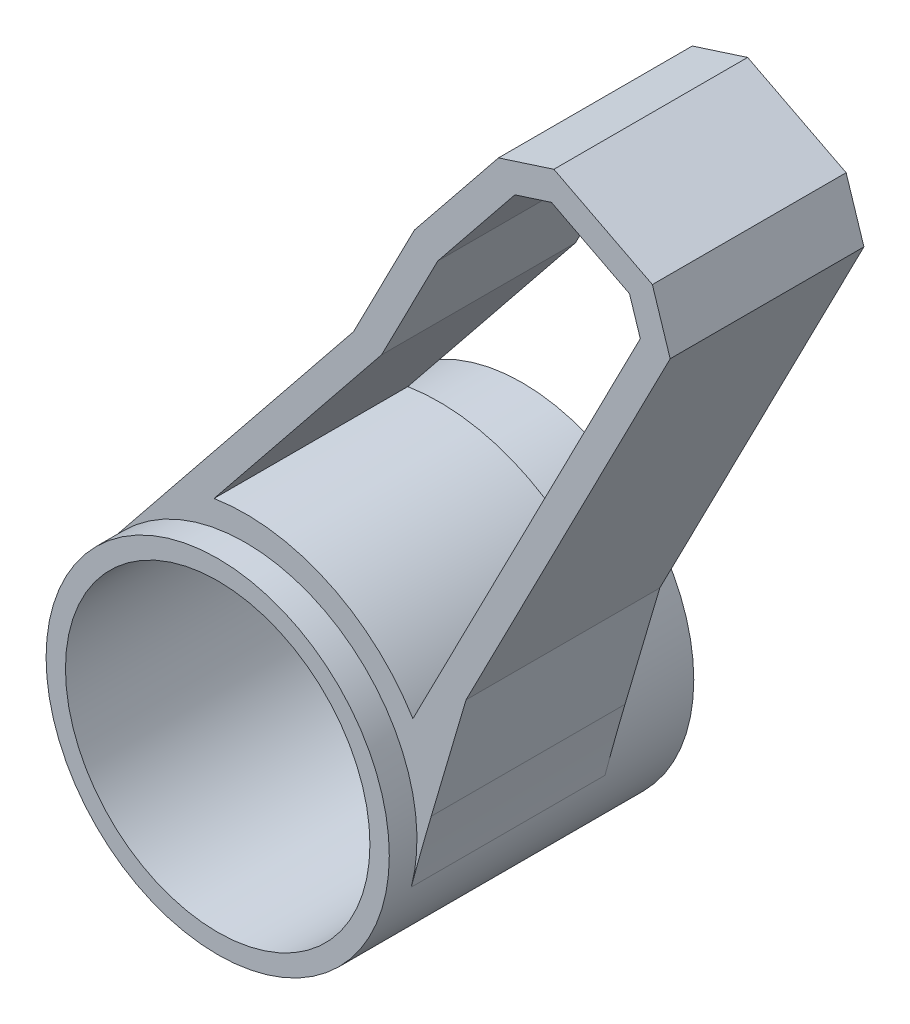
ISO-10303-21;
HEADER;
FILE_DESCRIPTION(('STEP AP214'),'2;1');
FILE_NAME('part.step','',(''),(''),'','','');
FILE_SCHEMA(('AUTOMOTIVE_DESIGN { 1 0 10303 214 1 1 1 1 }'));
ENDSEC;
DATA;
#1=APPLICATION_CONTEXT('core data for automotive mechanical design processes');
#2=APPLICATION_PROTOCOL_DEFINITION('international standard','automotive_design',2000,#1);
#3=PRODUCT_CONTEXT('',#1,'mechanical');
#4=PRODUCT('Part','Part','',(#3));
#5=PRODUCT_RELATED_PRODUCT_CATEGORY('part','',(#4));
#6=PRODUCT_DEFINITION_FORMATION('','',#4);
#7=PRODUCT_DEFINITION_CONTEXT('part definition',#1,'design');
#8=PRODUCT_DEFINITION('design','',#6,#7);
#9=PRODUCT_DEFINITION_SHAPE('','',#8);
#10=(LENGTH_UNIT() NAMED_UNIT(*) SI_UNIT(.MILLI.,.METRE.));
#11=(NAMED_UNIT(*) PLANE_ANGLE_UNIT() SI_UNIT($,.RADIAN.));
#12=(NAMED_UNIT(*) SI_UNIT($,.STERADIAN.) SOLID_ANGLE_UNIT());
#13=UNCERTAINTY_MEASURE_WITH_UNIT(LENGTH_MEASURE(1.E-05),#10,'distance_accuracy_value','');
#14=(GEOMETRIC_REPRESENTATION_CONTEXT(3) GLOBAL_UNCERTAINTY_ASSIGNED_CONTEXT((#13)) GLOBAL_UNIT_ASSIGNED_CONTEXT((#10,
#11,#12)) REPRESENTATION_CONTEXT('',''));
#15=CARTESIAN_POINT('',(0.,0.,0.));
#16=DIRECTION('',(0.,0.,1.));
#17=DIRECTION('',(1.,0.,0.));
#18=AXIS2_PLACEMENT_3D('',#15,#16,#17);
#19=CARTESIAN_POINT('',(-52.6853266003215,-72.8492094962946,78.9482020363931));
#20=DIRECTION('',(0.,0.,-1.));
#21=DIRECTION('',(-1.,0.,0.));
#22=AXIS2_PLACEMENT_3D('',#19,#20,#21);
#23=PLANE('',#22);
#24=CARTESIAN_POINT('',(-52.6853266003215,-72.8492094962946,78.9482020363931));
#25=DIRECTION('',(0.,0.,-1.));
#26=DIRECTION('',(-1.,0.,0.));
#27=AXIS2_PLACEMENT_3D('',#24,#25,#26);
#28=CIRCLE('',#27,31.);
#29=CARTESIAN_POINT('',(-76.8366995642436,-53.4144163675388,78.9482020363931));
#30=VERTEX_POINT('',#29);
#31=CARTESIAN_POINT('',(-22.7235091215742,-80.8046788960365,78.9482020363931));
#32=VERTEX_POINT('',#31);
#33=EDGE_CURVE('E65',#30,#32,#28,.T.);
#34=ORIENTED_EDGE('',*,*,#33,.T.);
#35=CARTESIAN_POINT('',(460.531611503383,-209.11870147252,78.9482020363931));
#36=DIRECTION('',(0.,0.,-1.));
#37=DIRECTION('',(-1.,0.,0.));
#38=AXIS2_PLACEMENT_3D('',#35,#36,#37);
#39=CIRCLE('',#38,500.);
#40=CARTESIAN_POINT('',(-19.110416452348,-67.8971556003906,78.9482020363931));
#41=VERTEX_POINT('',#40);
#42=EDGE_CURVE('E11',#32,#41,#39,.T.);
#43=ORIENTED_EDGE('',*,*,#42,.T.);
#44=DIRECTION('',(0.282443091744335,0.959284055911439,0.));
#45=VECTOR('',#44,1.);
#46=CARTESIAN_POINT('',(-12.8274445896791,-46.5577958930049,78.9482020363931));
#47=LINE('',#46,#45);
#48=CARTESIAN_POINT('',(-12.8274445896791,-46.5577958930049,78.9482020363931));
#49=VERTEX_POINT('',#48);
#50=EDGE_CURVE('E254',#41,#49,#47,.T.);
#51=ORIENTED_EDGE('',*,*,#50,.T.);
#52=DIRECTION('',(0.45683770868472,0.889550059256754,0.));
#53=VECTOR('',#52,1.);
#54=CARTESIAN_POINT('',(-12.8274445896791,-46.5577958930049,78.9482020363931));
#55=LINE('',#54,#53);
#56=CARTESIAN_POINT('',(24.048690339329,25.2470647558734,78.9482020363931));
#57=VERTEX_POINT('',#56);
#58=EDGE_CURVE('E256',#49,#57,#55,.T.);
#59=ORIENTED_EDGE('',*,*,#58,.T.);
#60=DIRECTION('',(-0.305973837392658,0.952039920818035,0.));
#61=VECTOR('',#60,1.);
#62=CARTESIAN_POINT('',(24.048690339329,25.2470647558734,78.9482020363931));
#63=LINE('',#62,#61);
#64=CARTESIAN_POINT('',(20.8348142118473,35.2470647558734,78.9482020363931));
#65=VERTEX_POINT('',#64);
#66=EDGE_CURVE('E258',#57,#65,#63,.T.);
#67=ORIENTED_EDGE('',*,*,#66,.T.);
#68=DIRECTION('',(-0.889550059256755,0.456837708684719,0.));
#69=VECTOR('',#68,1.);
#70=CARTESIAN_POINT('',(20.8348142118473,35.2470647558734,78.9482020363931));
#71=LINE('',#70,#69);
#72=CARTESIAN_POINT('',(3.04381302671223,44.3838189295678,78.9482020363931));
#73=VERTEX_POINT('',#72);
#74=EDGE_CURVE('E260',#65,#73,#71,.T.);
#75=ORIENTED_EDGE('',*,*,#74,.T.);
#76=DIRECTION('',(-0.952039920818035,-0.305973837392658,0.));
#77=VECTOR('',#76,1.);
#78=CARTESIAN_POINT('',(3.04381302671223,44.3838189295678,78.9482020363931));
#79=LINE('',#78,#77);
#80=CARTESIAN_POINT('',(-6.95618697328777,41.1699428020861,78.9482020363931));
#81=VERTEX_POINT('',#80);
#82=EDGE_CURVE('E262',#73,#81,#79,.T.);
#83=ORIENTED_EDGE('',*,*,#82,.T.);
#84=DIRECTION('',(-0.626914884282374,-0.779087753635762,0.));
#85=VECTOR('',#84,1.);
#86=CARTESIAN_POINT('',(-6.95618697328777,41.1699428020861,78.9482020363931));
#87=LINE('',#86,#85);
#88=CARTESIAN_POINT('',(-22.1494508739071,22.2887738595455,78.9482020363931));
#89=VERTEX_POINT('',#88);
#90=EDGE_CURVE('E264',#81,#89,#87,.T.);
#91=ORIENTED_EDGE('',*,*,#90,.T.);
#92=DIRECTION('',(-0.45683770868472,-0.889550059256754,0.));
#93=VECTOR('',#92,1.);
#94=CARTESIAN_POINT('',(-22.1494508739071,22.2887738595455,78.9482020363931));
#95=LINE('',#94,#93);
#96=CARTESIAN_POINT('',(-33.1388250854318,0.890368484469654,78.9482020363931));
#97=VERTEX_POINT('',#96);
#98=EDGE_CURVE('E246',#89,#97,#95,.T.);
#99=ORIENTED_EDGE('',*,*,#98,.T.);
#100=DIRECTION('',(-0.626914884282373,-0.779087753635762,0.));
#101=VECTOR('',#100,1.);
#102=CARTESIAN_POINT('',(-33.1388250854318,0.890368484469654,78.9482020363931));
#103=LINE('',#102,#101);
#104=CARTESIAN_POINT('',(-74.629445823951,-50.6713910439047,78.9482020363931));
#105=VERTEX_POINT('',#104);
#106=EDGE_CURVE('E249',#97,#105,#103,.T.);
#107=ORIENTED_EDGE('',*,*,#106,.T.);
#108=CARTESIAN_POINT('',(-77984.4914218936,62639.466644135,78.9482020363931));
#109=DIRECTION('',(0.,0.,-1.));
#110=DIRECTION('',(-1.,0.,0.));
#111=AXIS2_PLACEMENT_3D('',#108,#109,#110);
#112=CIRCLE('',#111,100000.);
#113=EDGE_CURVE('E310',#105,#30,#112,.T.);
#114=ORIENTED_EDGE('',*,*,#113,.T.);
#115=EDGE_LOOP('',(#34,#43,#51,#59,#67,#75,#83,#91,#99,#107,#114));
#116=FACE_BOUND('',#115,.T.);
#117=DIRECTION('',(-0.45683770868472,-0.889550059256754,0.));
#118=VECTOR('',#117,1.);
#119=CARTESIAN_POINT('',(-17.9345182286417,19.5512449912707,78.9482020363931));
#120=LINE('',#119,#118);
#121=CARTESIAN_POINT('',(-17.9345182286417,19.5512449912707,78.9482020363931));
#122=VERTEX_POINT('',#121);
#123=CARTESIAN_POINT('',(-28.071571338295,-0.187528807291181,78.9482020363931));
#124=VERTEX_POINT('',#123);
#125=EDGE_CURVE('E174',#122,#124,#120,.T.);
#126=ORIENTED_EDGE('',*,*,#125,.F.);
#127=DIRECTION('',(-0.626914884282373,-0.779087753635762,0.));
#128=VECTOR('',#127,1.);
#129=CARTESIAN_POINT('',(-17.9345182286417,19.5512449912707,78.9482020363931));
#130=LINE('',#129,#128);
#131=CARTESIAN_POINT('',(-3.99998394224289,36.8681492271272,78.9482020363931));
#132=VERTEX_POINT('',#131);
#133=EDGE_CURVE('E211',#132,#122,#130,.T.);
#134=ORIENTED_EDGE('',*,*,#133,.F.);
#135=DIRECTION('',(-0.952039920818035,-0.305973837392659,0.));
#136=VECTOR('',#135,1.);
#137=CARTESIAN_POINT('',(-3.99998394224289,36.8681492271273,78.9482020363931));
#138=LINE('',#137,#136);
#139=CARTESIAN_POINT('',(2.60194297805831,38.9899267595807,78.9482020363931));
#140=VERTEX_POINT('',#139);
#141=EDGE_CURVE('E208',#140,#132,#138,.T.);
#142=ORIENTED_EDGE('',*,*,#141,.F.);
#143=DIRECTION('',(-0.889550059256755,0.456837708684719,0.));
#144=VECTOR('',#143,1.);
#145=CARTESIAN_POINT('',(2.60194297805831,38.9899267595807,78.9482020363931));
#146=LINE('',#145,#144);
#147=CARTESIAN_POINT('',(16.708307173654,31.7454563332929,78.9482020363931));
#148=VERTEX_POINT('',#147);
#149=EDGE_CURVE('E206',#148,#140,#146,.T.);
#150=ORIENTED_EDGE('',*,*,#149,.F.);
#151=DIRECTION('',(-0.305973837392658,0.952039920818035,0.));
#152=VECTOR('',#151,1.);
#153=CARTESIAN_POINT('',(16.708307173654,31.7454563332929,78.9482020363931));
#154=LINE('',#153,#152);
#155=CARTESIAN_POINT('',(18.6547981693419,25.6889348045273,78.9482020363931));
#156=VERTEX_POINT('',#155);
#157=EDGE_CURVE('E204',#156,#148,#154,.T.);
#158=ORIENTED_EDGE('',*,*,#157,.F.);
#159=DIRECTION('',(0.45683770868472,0.889550059256754,0.));
#160=VECTOR('',#159,1.);
#161=CARTESIAN_POINT('',(18.6547981693419,25.6889348045273,78.9482020363931));
#162=LINE('',#161,#160);
#163=CARTESIAN_POINT('',(-22.4209617497573,-54.2933958468764,78.9482020363931));
#164=VERTEX_POINT('',#163);
#165=EDGE_CURVE('E199',#164,#156,#162,.T.);
#166=ORIENTED_EDGE('',*,*,#165,.F.);
#167=CARTESIAN_POINT('',(-52.6853266003215,-72.8492094962946,78.9482020363931));
#168=DIRECTION('',(0.,0.,-1.));
#169=DIRECTION('',(1.,0.,0.));
#170=AXIS2_PLACEMENT_3D('',#167,#168,#169);
#171=CIRCLE('',#170,35.5);
#172=CARTESIAN_POINT('',(-58.3394069977299,-37.8023640625092,78.9482020363931));
#173=VERTEX_POINT('',#172);
#174=EDGE_CURVE('E197',#173,#164,#171,.T.);
#175=ORIENTED_EDGE('',*,*,#174,.F.);
#176=DIRECTION('',(-0.626914884282373,-0.779087753635763,0.));
#177=VECTOR('',#176,1.);
#178=CARTESIAN_POINT('',(-28.071571338295,-0.187528807291181,78.9482020363931));
#179=LINE('',#178,#177);
#180=EDGE_CURVE('E184',#124,#173,#179,.T.);
#181=ORIENTED_EDGE('',*,*,#180,.F.);
#182=EDGE_LOOP('',(#126,#134,#142,#150,#158,#166,#175,#181));
#183=FACE_BOUND('',#182,.T.);
#184=ADVANCED_FACE('F43',(#116,#183),#23,.F.);
#185=CARTESIAN_POINT('',(-52.6853266003215,-72.8492094962946,43.9482020363931));
#186=DIRECTION('',(0.,0.,-1.));
#187=DIRECTION('',(-1.,0.,0.));
#188=AXIS2_PLACEMENT_3D('',#185,#186,#187);
#189=PLANE('',#188);
#190=DIRECTION('',(0.282443091744335,0.959284055911439,0.));
#191=VECTOR('',#190,1.);
#192=CARTESIAN_POINT('',(-12.8274445896791,-46.5577958930049,43.9482020363931));
#193=LINE('',#192,#191);
#194=CARTESIAN_POINT('',(-19.110416452348,-67.8971556003906,43.9482020363931));
#195=VERTEX_POINT('',#194);
#196=CARTESIAN_POINT('',(-12.8274445896791,-46.5577958930049,43.9482020363931));
#197=VERTEX_POINT('',#196);
#198=EDGE_CURVE('E273',#195,#197,#193,.T.);
#199=ORIENTED_EDGE('',*,*,#198,.F.);
#200=CARTESIAN_POINT('',(460.531611503383,-209.11870147252,43.9482020363931));
#201=DIRECTION('',(0.,0.,-1.));
#202=DIRECTION('',(-1.,0.,0.));
#203=AXIS2_PLACEMENT_3D('',#200,#201,#202);
#204=CIRCLE('',#203,500.);
#205=CARTESIAN_POINT('',(-22.7235091215742,-80.8046788960365,43.9482020363931));
#206=VERTEX_POINT('',#205);
#207=EDGE_CURVE('E51',#195,#206,#204,.F.);
#208=ORIENTED_EDGE('',*,*,#207,.T.);
#209=CARTESIAN_POINT('',(-52.6853266003215,-72.8492094962946,43.9482020363931));
#210=DIRECTION('',(0.,0.,-1.));
#211=DIRECTION('',(-1.,0.,0.));
#212=AXIS2_PLACEMENT_3D('',#209,#210,#211);
#213=CIRCLE('',#212,31.);
#214=CARTESIAN_POINT('',(-76.8366995642436,-53.4144163675388,43.9482020363931));
#215=VERTEX_POINT('',#214);
#216=EDGE_CURVE('E58',#215,#206,#213,.T.);
#217=ORIENTED_EDGE('',*,*,#216,.F.);
#218=CARTESIAN_POINT('',(-77984.4914218936,62639.466644135,43.9482020363931));
#219=DIRECTION('',(0.,0.,-1.));
#220=DIRECTION('',(-1.,0.,0.));
#221=AXIS2_PLACEMENT_3D('',#218,#219,#220);
#222=CIRCLE('',#221,100000.);
#223=CARTESIAN_POINT('',(-74.629445823951,-50.6713910439047,43.9482020363931));
#224=VERTEX_POINT('',#223);
#225=EDGE_CURVE('E308',#215,#224,#222,.F.);
#226=ORIENTED_EDGE('',*,*,#225,.T.);
#227=DIRECTION('',(-0.626914884282373,-0.779087753635762,0.));
#228=VECTOR('',#227,1.);
#229=CARTESIAN_POINT('',(-33.1388250854318,0.890368484469654,43.9482020363931));
#230=LINE('',#229,#228);
#231=CARTESIAN_POINT('',(-33.1388250854318,0.890368484469654,43.9482020363931));
#232=VERTEX_POINT('',#231);
#233=EDGE_CURVE('E269',#232,#224,#230,.T.);
#234=ORIENTED_EDGE('',*,*,#233,.F.);
#235=DIRECTION('',(-0.45683770868472,-0.889550059256754,0.));
#236=VECTOR('',#235,1.);
#237=CARTESIAN_POINT('',(-22.1494508739071,22.2887738595455,43.9482020363931));
#238=LINE('',#237,#236);
#239=CARTESIAN_POINT('',(-22.1494508739071,22.2887738595455,43.9482020363931));
#240=VERTEX_POINT('',#239);
#241=EDGE_CURVE('E192',#240,#232,#238,.T.);
#242=ORIENTED_EDGE('',*,*,#241,.F.);
#243=DIRECTION('',(-0.626914884282374,-0.779087753635762,0.));
#244=VECTOR('',#243,1.);
#245=CARTESIAN_POINT('',(-6.95618697328777,41.1699428020861,43.9482020363931));
#246=LINE('',#245,#244);
#247=CARTESIAN_POINT('',(-6.95618697328777,41.1699428020861,43.9482020363931));
#248=VERTEX_POINT('',#247);
#249=EDGE_CURVE('E250',#248,#240,#246,.T.);
#250=ORIENTED_EDGE('',*,*,#249,.F.);
#251=DIRECTION('',(-0.952039920818035,-0.305973837392658,0.));
#252=VECTOR('',#251,1.);
#253=CARTESIAN_POINT('',(3.04381302671223,44.3838189295678,43.9482020363931));
#254=LINE('',#253,#252);
#255=CARTESIAN_POINT('',(3.04381302671223,44.3838189295678,43.9482020363931));
#256=VERTEX_POINT('',#255);
#257=EDGE_CURVE('E281',#256,#248,#254,.T.);
#258=ORIENTED_EDGE('',*,*,#257,.F.);
#259=DIRECTION('',(-0.889550059256755,0.456837708684719,0.));
#260=VECTOR('',#259,1.);
#261=CARTESIAN_POINT('',(20.8348142118473,35.2470647558734,43.9482020363931));
#262=LINE('',#261,#260);
#263=CARTESIAN_POINT('',(20.8348142118473,35.2470647558734,43.9482020363931));
#264=VERTEX_POINT('',#263);
#265=EDGE_CURVE('E279',#264,#256,#262,.T.);
#266=ORIENTED_EDGE('',*,*,#265,.F.);
#267=DIRECTION('',(-0.305973837392658,0.952039920818035,0.));
#268=VECTOR('',#267,1.);
#269=CARTESIAN_POINT('',(24.048690339329,25.2470647558734,43.9482020363931));
#270=LINE('',#269,#268);
#271=CARTESIAN_POINT('',(24.048690339329,25.2470647558734,43.9482020363931));
#272=VERTEX_POINT('',#271);
#273=EDGE_CURVE('E277',#272,#264,#270,.T.);
#274=ORIENTED_EDGE('',*,*,#273,.F.);
#275=DIRECTION('',(0.45683770868472,0.889550059256754,0.));
#276=VECTOR('',#275,1.);
#277=CARTESIAN_POINT('',(-12.8274445896791,-46.5577958930049,43.9482020363931));
#278=LINE('',#277,#276);
#279=EDGE_CURVE('E275',#197,#272,#278,.T.);
#280=ORIENTED_EDGE('',*,*,#279,.F.);
#281=EDGE_LOOP('',(#199,#208,#217,#226,#234,#242,#250,#258,#266,#274,#280));
#282=FACE_BOUND('',#281,.T.);
#283=DIRECTION('',(-0.626914884282373,-0.779087753635762,0.));
#284=VECTOR('',#283,1.);
#285=CARTESIAN_POINT('',(-17.9345182286417,19.5512449912707,43.9482020363931));
#286=LINE('',#285,#284);
#287=CARTESIAN_POINT('',(-3.99998394224289,36.8681492271273,43.9482020363931));
#288=VERTEX_POINT('',#287);
#289=CARTESIAN_POINT('',(-17.9345182286417,19.5512449912707,43.9482020363931));
#290=VERTEX_POINT('',#289);
#291=EDGE_CURVE('E185',#288,#290,#286,.T.);
#292=ORIENTED_EDGE('',*,*,#291,.T.);
#293=DIRECTION('',(-0.45683770868472,-0.889550059256754,0.));
#294=VECTOR('',#293,1.);
#295=CARTESIAN_POINT('',(-17.9345182286417,19.5512449912707,43.9482020363931));
#296=LINE('',#295,#294);
#297=CARTESIAN_POINT('',(-28.071571338295,-0.187528807291181,43.9482020363931));
#298=VERTEX_POINT('',#297);
#299=EDGE_CURVE('E213',#290,#298,#296,.T.);
#300=ORIENTED_EDGE('',*,*,#299,.T.);
#301=DIRECTION('',(-0.626914884282373,-0.779087753635763,0.));
#302=VECTOR('',#301,1.);
#303=CARTESIAN_POINT('',(-28.071571338295,-0.187528807291181,43.9482020363931));
#304=LINE('',#303,#302);
#305=CARTESIAN_POINT('',(-58.3394069977299,-37.8023640625092,43.9482020363931));
#306=VERTEX_POINT('',#305);
#307=EDGE_CURVE('E191',#298,#306,#304,.T.);
#308=ORIENTED_EDGE('',*,*,#307,.T.);
#309=CARTESIAN_POINT('',(-52.6853266003215,-72.8492094962946,43.9482020363931));
#310=DIRECTION('',(0.,0.,-1.));
#311=DIRECTION('',(1.,0.,0.));
#312=AXIS2_PLACEMENT_3D('',#309,#310,#311);
#313=CIRCLE('',#312,35.5);
#314=CARTESIAN_POINT('',(-22.4209617497573,-54.2933958468764,43.9482020363931));
#315=VERTEX_POINT('',#314);
#316=EDGE_CURVE('E217',#306,#315,#313,.T.);
#317=ORIENTED_EDGE('',*,*,#316,.T.);
#318=DIRECTION('',(0.45683770868472,0.889550059256754,0.));
#319=VECTOR('',#318,1.);
#320=CARTESIAN_POINT('',(18.6547981693419,25.6889348045273,43.9482020363931));
#321=LINE('',#320,#319);
#322=CARTESIAN_POINT('',(18.6547981693419,25.6889348045273,43.9482020363931));
#323=VERTEX_POINT('',#322);
#324=EDGE_CURVE('E220',#315,#323,#321,.T.);
#325=ORIENTED_EDGE('',*,*,#324,.T.);
#326=DIRECTION('',(-0.305973837392658,0.952039920818035,0.));
#327=VECTOR('',#326,1.);
#328=CARTESIAN_POINT('',(16.708307173654,31.7454563332929,43.9482020363931));
#329=LINE('',#328,#327);
#330=CARTESIAN_POINT('',(16.708307173654,31.7454563332929,43.9482020363931));
#331=VERTEX_POINT('',#330);
#332=EDGE_CURVE('E223',#323,#331,#329,.T.);
#333=ORIENTED_EDGE('',*,*,#332,.T.);
#334=DIRECTION('',(-0.889550059256755,0.456837708684719,0.));
#335=VECTOR('',#334,1.);
#336=CARTESIAN_POINT('',(2.60194297805831,38.9899267595807,43.9482020363931));
#337=LINE('',#336,#335);
#338=CARTESIAN_POINT('',(2.60194297805831,38.9899267595807,43.9482020363931));
#339=VERTEX_POINT('',#338);
#340=EDGE_CURVE('E226',#331,#339,#337,.T.);
#341=ORIENTED_EDGE('',*,*,#340,.T.);
#342=DIRECTION('',(-0.952039920818035,-0.305973837392659,0.));
#343=VECTOR('',#342,1.);
#344=CARTESIAN_POINT('',(-3.99998394224289,36.8681492271273,43.9482020363931));
#345=LINE('',#344,#343);
#346=EDGE_CURVE('E229',#339,#288,#345,.T.);
#347=ORIENTED_EDGE('',*,*,#346,.T.);
#348=EDGE_LOOP('',(#292,#300,#308,#317,#325,#333,#341,#347));
#349=FACE_BOUND('',#348,.T.);
#350=ADVANCED_FACE('F319',(#282,#349),#189,.T.);
#351=CARTESIAN_POINT('',(-22.1494508739071,22.2887738595455,78.9482020363931));
#352=DIRECTION('',(0.889550059256754,-0.45683770868472,0.));
#353=DIRECTION('',(0.45683770868472,0.889550059256754,0.));
#354=AXIS2_PLACEMENT_3D('',#351,#352,#353);
#355=PLANE('',#354);
#356=ORIENTED_EDGE('',*,*,#241,.T.);
#357=DIRECTION('',(0.,0.,-1.));
#358=VECTOR('',#357,1.);
#359=CARTESIAN_POINT('',(-33.1388250854318,0.890368484469654,78.9482020363931));
#360=LINE('',#359,#358);
#361=EDGE_CURVE('E301',#97,#232,#360,.T.);
#362=ORIENTED_EDGE('',*,*,#361,.F.);
#363=ORIENTED_EDGE('',*,*,#98,.F.);
#364=DIRECTION('',(0.,0.,-1.));
#365=VECTOR('',#364,1.);
#366=CARTESIAN_POINT('',(-22.1494508739071,22.2887738595455,78.9482020363931));
#367=LINE('',#366,#365);
#368=EDGE_CURVE('E266',#89,#240,#367,.T.);
#369=ORIENTED_EDGE('',*,*,#368,.T.);
#370=EDGE_LOOP('',(#356,#362,#363,#369));
#371=FACE_BOUND('',#370,.T.);
#372=ADVANCED_FACE('F339',(#371),#355,.F.);
#373=CARTESIAN_POINT('',(-33.1388250854318,0.890368484469654,78.9482020363931));
#374=DIRECTION('',(0.779087753635762,-0.626914884282373,0.));
#375=DIRECTION('',(0.626914884282373,0.779087753635762,0.));
#376=AXIS2_PLACEMENT_3D('',#373,#374,#375);
#377=PLANE('',#376);
#378=ORIENTED_EDGE('',*,*,#233,.T.);
#379=DIRECTION('',(0.,0.,-1.));
#380=VECTOR('',#379,1.);
#381=CARTESIAN_POINT('',(-74.629445823951,-50.6713910439047,78.9482020363931));
#382=LINE('',#381,#380);
#383=EDGE_CURVE('E304',#224,#105,#382,.F.);
#384=ORIENTED_EDGE('',*,*,#383,.T.);
#385=ORIENTED_EDGE('',*,*,#106,.F.);
#386=ORIENTED_EDGE('',*,*,#361,.T.);
#387=EDGE_LOOP('',(#378,#384,#385,#386));
#388=FACE_BOUND('',#387,.T.);
#389=ADVANCED_FACE('F335',(#388),#377,.F.);
#390=CARTESIAN_POINT('',(-12.8274445896791,-46.5577958930049,78.9482020363931));
#391=DIRECTION('',(-0.959284055911439,0.282443091744335,0.));
#392=DIRECTION('',(-0.282443091744335,-0.959284055911439,0.));
#393=AXIS2_PLACEMENT_3D('',#390,#391,#392);
#394=PLANE('',#393);
#395=ORIENTED_EDGE('',*,*,#50,.F.);
#396=DIRECTION('',(0.,0.,1.));
#397=VECTOR('',#396,1.);
#398=CARTESIAN_POINT('',(-19.1104164523368,-67.8971556003526,83.9482020363931));
#399=LINE('',#398,#397);
#400=EDGE_CURVE('E312',#41,#195,#399,.F.);
#401=ORIENTED_EDGE('',*,*,#400,.T.);
#402=ORIENTED_EDGE('',*,*,#198,.T.);
#403=DIRECTION('',(0.,0.,-1.));
#404=VECTOR('',#403,1.);
#405=CARTESIAN_POINT('',(-12.8274445896791,-46.5577958930049,78.9482020363931));
#406=LINE('',#405,#404);
#407=EDGE_CURVE('E298',#49,#197,#406,.T.);
#408=ORIENTED_EDGE('',*,*,#407,.F.);
#409=EDGE_LOOP('',(#395,#401,#402,#408));
#410=FACE_BOUND('',#409,.T.);
#411=ADVANCED_FACE('F367',(#410),#394,.F.);
#412=CARTESIAN_POINT('',(-12.8274445896791,-46.5577958930049,78.9482020363931));
#413=DIRECTION('',(-0.889550059256754,0.45683770868472,0.));
#414=DIRECTION('',(-0.45683770868472,-0.889550059256754,0.));
#415=AXIS2_PLACEMENT_3D('',#412,#413,#414);
#416=PLANE('',#415);
#417=ORIENTED_EDGE('',*,*,#279,.T.);
#418=DIRECTION('',(0.,0.,-1.));
#419=VECTOR('',#418,1.);
#420=CARTESIAN_POINT('',(24.048690339329,25.2470647558734,78.9482020363931));
#421=LINE('',#420,#419);
#422=EDGE_CURVE('E295',#57,#272,#421,.T.);
#423=ORIENTED_EDGE('',*,*,#422,.F.);
#424=ORIENTED_EDGE('',*,*,#58,.F.);
#425=ORIENTED_EDGE('',*,*,#407,.T.);
#426=EDGE_LOOP('',(#417,#423,#424,#425));
#427=FACE_BOUND('',#426,.T.);
#428=ADVANCED_FACE('F363',(#427),#416,.F.);
#429=CARTESIAN_POINT('',(24.048690339329,25.2470647558734,78.9482020363931));
#430=DIRECTION('',(-0.952039920818035,-0.305973837392658,0.));
#431=DIRECTION('',(0.305973837392658,-0.952039920818035,0.));
#432=AXIS2_PLACEMENT_3D('',#429,#430,#431);
#433=PLANE('',#432);
#434=ORIENTED_EDGE('',*,*,#273,.T.);
#435=DIRECTION('',(0.,0.,-1.));
#436=VECTOR('',#435,1.);
#437=CARTESIAN_POINT('',(20.8348142118473,35.2470647558734,78.9482020363931));
#438=LINE('',#437,#436);
#439=EDGE_CURVE('E292',#65,#264,#438,.T.);
#440=ORIENTED_EDGE('',*,*,#439,.F.);
#441=ORIENTED_EDGE('',*,*,#66,.F.);
#442=ORIENTED_EDGE('',*,*,#422,.T.);
#443=EDGE_LOOP('',(#434,#440,#441,#442));
#444=FACE_BOUND('',#443,.T.);
#445=ADVANCED_FACE('F358',(#444),#433,.F.);
#446=CARTESIAN_POINT('',(20.8348142118473,35.2470647558734,78.9482020363931));
#447=DIRECTION('',(-0.456837708684719,-0.889550059256755,0.));
#448=DIRECTION('',(0.889550059256755,-0.456837708684719,0.));
#449=AXIS2_PLACEMENT_3D('',#446,#447,#448);
#450=PLANE('',#449);
#451=ORIENTED_EDGE('',*,*,#265,.T.);
#452=DIRECTION('',(0.,0.,-1.));
#453=VECTOR('',#452,1.);
#454=CARTESIAN_POINT('',(3.04381302671223,44.3838189295678,78.9482020363931));
#455=LINE('',#454,#453);
#456=EDGE_CURVE('E289',#73,#256,#455,.T.);
#457=ORIENTED_EDGE('',*,*,#456,.F.);
#458=ORIENTED_EDGE('',*,*,#74,.F.);
#459=ORIENTED_EDGE('',*,*,#439,.T.);
#460=EDGE_LOOP('',(#451,#457,#458,#459));
#461=FACE_BOUND('',#460,.T.);
#462=ADVANCED_FACE('F354',(#461),#450,.F.);
#463=CARTESIAN_POINT('',(3.04381302671223,44.3838189295678,78.9482020363931));
#464=DIRECTION('',(0.305973837392658,-0.952039920818035,0.));
#465=DIRECTION('',(0.952039920818035,0.305973837392658,0.));
#466=AXIS2_PLACEMENT_3D('',#463,#464,#465);
#467=PLANE('',#466);
#468=ORIENTED_EDGE('',*,*,#257,.T.);
#469=DIRECTION('',(0.,0.,-1.));
#470=VECTOR('',#469,1.);
#471=CARTESIAN_POINT('',(-6.95618697328777,41.1699428020861,78.9482020363931));
#472=LINE('',#471,#470);
#473=EDGE_CURVE('E286',#81,#248,#472,.T.);
#474=ORIENTED_EDGE('',*,*,#473,.F.);
#475=ORIENTED_EDGE('',*,*,#82,.F.);
#476=ORIENTED_EDGE('',*,*,#456,.T.);
#477=EDGE_LOOP('',(#468,#474,#475,#476));
#478=FACE_BOUND('',#477,.T.);
#479=ADVANCED_FACE('F350',(#478),#467,.F.);
#480=CARTESIAN_POINT('',(-6.95618697328777,41.1699428020861,78.9482020363931));
#481=DIRECTION('',(0.779087753635762,-0.626914884282374,0.));
#482=DIRECTION('',(0.626914884282374,0.779087753635762,0.));
#483=AXIS2_PLACEMENT_3D('',#480,#481,#482);
#484=PLANE('',#483);
#485=ORIENTED_EDGE('',*,*,#249,.T.);
#486=ORIENTED_EDGE('',*,*,#368,.F.);
#487=ORIENTED_EDGE('',*,*,#90,.F.);
#488=ORIENTED_EDGE('',*,*,#473,.T.);
#489=EDGE_LOOP('',(#485,#486,#487,#488));
#490=FACE_BOUND('',#489,.T.);
#491=ADVANCED_FACE('F345',(#490),#484,.F.);
#492=CARTESIAN_POINT('',(-17.9345182286417,19.5512449912707,78.9482020363931));
#493=DIRECTION('',(0.889550059256754,-0.45683770868472,0.));
#494=DIRECTION('',(0.45683770868472,0.889550059256754,0.));
#495=AXIS2_PLACEMENT_3D('',#492,#493,#494);
#496=PLANE('',#495);
#497=ORIENTED_EDGE('',*,*,#299,.F.);
#498=DIRECTION('',(0.,0.,-1.));
#499=VECTOR('',#498,1.);
#500=CARTESIAN_POINT('',(-17.9345182286417,19.5512449912707,78.9482020363931));
#501=LINE('',#500,#499);
#502=EDGE_CURVE('E180',#122,#290,#501,.T.);
#503=ORIENTED_EDGE('',*,*,#502,.F.);
#504=ORIENTED_EDGE('',*,*,#125,.T.);
#505=DIRECTION('',(0.,0.,-1.));
#506=VECTOR('',#505,1.);
#507=CARTESIAN_POINT('',(-28.071571338295,-0.187528807291181,78.9482020363931));
#508=LINE('',#507,#506);
#509=EDGE_CURVE('E177',#124,#298,#508,.T.);
#510=ORIENTED_EDGE('',*,*,#509,.T.);
#511=EDGE_LOOP('',(#497,#503,#504,#510));
#512=FACE_BOUND('',#511,.T.);
#513=ADVANCED_FACE('F176',(#512),#496,.T.);
#514=CARTESIAN_POINT('',(-28.071571338295,-0.187528807291181,78.9482020363931));
#515=DIRECTION('',(0.779087753635762,-0.626914884282373,0.));
#516=DIRECTION('',(0.626914884282373,0.779087753635762,0.));
#517=AXIS2_PLACEMENT_3D('',#514,#515,#516);
#518=PLANE('',#517);
#519=ORIENTED_EDGE('',*,*,#307,.F.);
#520=ORIENTED_EDGE('',*,*,#509,.F.);
#521=ORIENTED_EDGE('',*,*,#180,.T.);
#522=DIRECTION('',(0.,0.,-1.));
#523=VECTOR('',#522,1.);
#524=CARTESIAN_POINT('',(-58.3394069977299,-37.8023640625092,78.9482020363931));
#525=LINE('',#524,#523);
#526=EDGE_CURVE('E193',#173,#306,#525,.T.);
#527=ORIENTED_EDGE('',*,*,#526,.T.);
#528=EDGE_LOOP('',(#519,#520,#521,#527));
#529=FACE_BOUND('',#528,.T.);
#530=ADVANCED_FACE('F188',(#529),#518,.T.);
#531=CARTESIAN_POINT('',(-52.6853266003215,-72.8492094962946,78.9482020363931));
#532=DIRECTION('',(0.,0.,-1.));
#533=DIRECTION('',(-1.,0.,0.));
#534=AXIS2_PLACEMENT_3D('',#531,#532,#533);
#535=CYLINDRICAL_SURFACE('',#534,35.5);
#536=ORIENTED_EDGE('',*,*,#316,.F.);
#537=ORIENTED_EDGE('',*,*,#526,.F.);
#538=ORIENTED_EDGE('',*,*,#174,.T.);
#539=DIRECTION('',(0.,0.,-1.));
#540=VECTOR('',#539,1.);
#541=CARTESIAN_POINT('',(-22.4209617497573,-54.2933958468764,78.9482020363931));
#542=LINE('',#541,#540);
#543=EDGE_CURVE('E243',#164,#315,#542,.T.);
#544=ORIENTED_EDGE('',*,*,#543,.T.);
#545=EDGE_LOOP('',(#536,#537,#538,#544));
#546=FACE_BOUND('',#545,.T.);
#547=ADVANCED_FACE('F447',(#546),#535,.T.);
#548=CARTESIAN_POINT('',(18.6547981693419,25.6889348045273,78.9482020363931));
#549=DIRECTION('',(-0.889550059256754,0.45683770868472,0.));
#550=DIRECTION('',(-0.45683770868472,-0.889550059256754,0.));
#551=AXIS2_PLACEMENT_3D('',#548,#549,#550);
#552=PLANE('',#551);
#553=ORIENTED_EDGE('',*,*,#324,.F.);
#554=ORIENTED_EDGE('',*,*,#543,.F.);
#555=ORIENTED_EDGE('',*,*,#165,.T.);
#556=DIRECTION('',(0.,0.,-1.));
#557=VECTOR('',#556,1.);
#558=CARTESIAN_POINT('',(18.6547981693419,25.6889348045273,78.9482020363931));
#559=LINE('',#558,#557);
#560=EDGE_CURVE('E241',#156,#323,#559,.T.);
#561=ORIENTED_EDGE('',*,*,#560,.T.);
#562=EDGE_LOOP('',(#553,#554,#555,#561));
#563=FACE_BOUND('',#562,.T.);
#564=ADVANCED_FACE('F454',(#563),#552,.T.);
#565=CARTESIAN_POINT('',(16.708307173654,31.7454563332929,78.9482020363931));
#566=DIRECTION('',(-0.952039920818035,-0.305973837392658,0.));
#567=DIRECTION('',(0.305973837392658,-0.952039920818035,0.));
#568=AXIS2_PLACEMENT_3D('',#565,#566,#567);
#569=PLANE('',#568);
#570=ORIENTED_EDGE('',*,*,#332,.F.);
#571=ORIENTED_EDGE('',*,*,#560,.F.);
#572=ORIENTED_EDGE('',*,*,#157,.T.);
#573=DIRECTION('',(0.,0.,-1.));
#574=VECTOR('',#573,1.);
#575=CARTESIAN_POINT('',(16.708307173654,31.7454563332929,78.9482020363931));
#576=LINE('',#575,#574);
#577=EDGE_CURVE('E239',#148,#331,#576,.T.);
#578=ORIENTED_EDGE('',*,*,#577,.T.);
#579=EDGE_LOOP('',(#570,#571,#572,#578));
#580=FACE_BOUND('',#579,.T.);
#581=ADVANCED_FACE('F463',(#580),#569,.T.);
#582=CARTESIAN_POINT('',(2.60194297805831,38.9899267595807,78.9482020363931));
#583=DIRECTION('',(-0.456837708684719,-0.889550059256755,0.));
#584=DIRECTION('',(0.889550059256755,-0.456837708684719,0.));
#585=AXIS2_PLACEMENT_3D('',#582,#583,#584);
#586=PLANE('',#585);
#587=ORIENTED_EDGE('',*,*,#340,.F.);
#588=ORIENTED_EDGE('',*,*,#577,.F.);
#589=ORIENTED_EDGE('',*,*,#149,.T.);
#590=DIRECTION('',(0.,0.,-1.));
#591=VECTOR('',#590,1.);
#592=CARTESIAN_POINT('',(2.60194297805831,38.9899267595807,78.9482020363931));
#593=LINE('',#592,#591);
#594=EDGE_CURVE('E237',#140,#339,#593,.T.);
#595=ORIENTED_EDGE('',*,*,#594,.T.);
#596=EDGE_LOOP('',(#587,#588,#589,#595));
#597=FACE_BOUND('',#596,.T.);
#598=ADVANCED_FACE('F472',(#597),#586,.T.);
#599=CARTESIAN_POINT('',(-3.99998394224289,36.8681492271273,78.9482020363931));
#600=DIRECTION('',(0.305973837392659,-0.952039920818035,0.));
#601=DIRECTION('',(0.952039920818035,0.305973837392659,0.));
#602=AXIS2_PLACEMENT_3D('',#599,#600,#601);
#603=PLANE('',#602);
#604=ORIENTED_EDGE('',*,*,#346,.F.);
#605=ORIENTED_EDGE('',*,*,#594,.F.);
#606=ORIENTED_EDGE('',*,*,#141,.T.);
#607=DIRECTION('',(0.,0.,-1.));
#608=VECTOR('',#607,1.);
#609=CARTESIAN_POINT('',(-3.99998394224289,36.8681492271273,78.9482020363931));
#610=LINE('',#609,#608);
#611=EDGE_CURVE('E235',#132,#288,#610,.T.);
#612=ORIENTED_EDGE('',*,*,#611,.T.);
#613=EDGE_LOOP('',(#604,#605,#606,#612));
#614=FACE_BOUND('',#613,.T.);
#615=ADVANCED_FACE('F481',(#614),#603,.T.);
#616=CARTESIAN_POINT('',(-17.9345182286417,19.5512449912707,78.9482020363931));
#617=DIRECTION('',(0.779087753635762,-0.626914884282374,0.));
#618=DIRECTION('',(0.626914884282374,0.779087753635762,0.));
#619=AXIS2_PLACEMENT_3D('',#616,#617,#618);
#620=PLANE('',#619);
#621=ORIENTED_EDGE('',*,*,#291,.F.);
#622=ORIENTED_EDGE('',*,*,#611,.F.);
#623=ORIENTED_EDGE('',*,*,#133,.T.);
#624=ORIENTED_EDGE('',*,*,#502,.T.);
#625=EDGE_LOOP('',(#621,#622,#623,#624));
#626=FACE_BOUND('',#625,.T.);
#627=ADVANCED_FACE('F490',(#626),#620,.T.);
#628=CARTESIAN_POINT('',(-52.6853266003215,-72.8492094962946,83.9482020363931));
#629=DIRECTION('',(0.,0.,-1.));
#630=DIRECTION('',(0.,1.,0.));
#631=AXIS2_PLACEMENT_3D('',#628,#629,#630);
#632=CYLINDRICAL_SURFACE('',#631,27.5);
#633=CARTESIAN_POINT('',(-52.6853266003215,-72.8492094962946,83.9482020363931));
#634=DIRECTION('',(0.,0.,1.));
#635=DIRECTION('',(0.,-1.,0.));
#636=AXIS2_PLACEMENT_3D('',#633,#634,#635);
#637=CIRCLE('',#636,27.5);
#638=CARTESIAN_POINT('',(-52.6853266003215,-100.349209496295,83.9482020363931));
#639=VERTEX_POINT('',#638);
#640=EDGE_CURVE('E601',#639,#639,#637,.T.);
#641=ORIENTED_EDGE('',*,*,#640,.T.);
#642=EDGE_LOOP('',(#641));
#643=FACE_BOUND('',#642,.T.);
#644=CARTESIAN_POINT('',(-52.6853266003215,-72.8492094962946,30.948202036393));
#645=DIRECTION('',(0.,0.,1.));
#646=DIRECTION('',(0.,-1.,0.));
#647=AXIS2_PLACEMENT_3D('',#644,#645,#646);
#648=CIRCLE('',#647,27.5);
#649=CARTESIAN_POINT('',(-52.6853266003215,-100.349209496295,30.948202036393));
#650=VERTEX_POINT('',#649);
#651=EDGE_CURVE('E599',#650,#650,#648,.T.);
#652=ORIENTED_EDGE('',*,*,#651,.F.);
#653=EDGE_LOOP('',(#652));
#654=FACE_BOUND('',#653,.T.);
#655=ADVANCED_FACE('F499',(#643,#654),#632,.F.);
#656=CARTESIAN_POINT('',(-52.6853266003215,-72.8492094962946,83.9482020363931));
#657=DIRECTION('',(0.,0.,-1.));
#658=DIRECTION('',(0.,1.,0.));
#659=AXIS2_PLACEMENT_3D('',#656,#657,#658);
#660=CYLINDRICAL_SURFACE('',#659,31.);
#661=ORIENTED_EDGE('',*,*,#216,.T.);
#662=DIRECTION('',(0.,0.,-1.));
#663=VECTOR('',#662,1.);
#664=CARTESIAN_POINT('',(-22.7235091215742,-80.8046788960365,83.9482020363931));
#665=LINE('',#664,#663);
#666=EDGE_CURVE('E315',#206,#32,#665,.F.);
#667=ORIENTED_EDGE('',*,*,#666,.T.);
#668=ORIENTED_EDGE('',*,*,#33,.F.);
#669=DIRECTION('',(0.,0.,-1.));
#670=VECTOR('',#669,1.);
#671=CARTESIAN_POINT('',(-76.8366995642436,-53.4144163675388,83.9482020363931));
#672=LINE('',#671,#670);
#673=EDGE_CURVE('E306',#30,#215,#672,.T.);
#674=ORIENTED_EDGE('',*,*,#673,.T.);
#675=EDGE_LOOP('',(#661,#667,#668,#674));
#676=FACE_BOUND('',#675,.T.);
#677=CARTESIAN_POINT('',(-52.6853266003215,-72.8492094962946,83.9482020363931));
#678=DIRECTION('',(0.,0.,1.));
#679=DIRECTION('',(0.,-1.,0.));
#680=AXIS2_PLACEMENT_3D('',#677,#678,#679);
#681=CIRCLE('',#680,31.);
#682=CARTESIAN_POINT('',(-52.6853266003215,-103.849209496295,83.9482020363931));
#683=VERTEX_POINT('',#682);
#684=EDGE_CURVE('E215',#683,#683,#681,.T.);
#685=ORIENTED_EDGE('',*,*,#684,.F.);
#686=EDGE_LOOP('',(#685));
#687=FACE_BOUND('',#686,.T.);
#688=CARTESIAN_POINT('',(-52.6853266003215,-72.8492094962946,28.948202036393));
#689=DIRECTION('',(0.,0.,-1.));
#690=DIRECTION('',(0.,1.,0.));
#691=AXIS2_PLACEMENT_3D('',#688,#689,#690);
#692=CIRCLE('',#691,31.);
#693=CARTESIAN_POINT('',(-52.6853266003215,-41.8492094962946,28.948202036393));
#694=VERTEX_POINT('',#693);
#695=EDGE_CURVE('E602',#694,#694,#692,.T.);
#696=ORIENTED_EDGE('',*,*,#695,.F.);
#697=EDGE_LOOP('',(#696));
#698=FACE_BOUND('',#697,.T.);
#699=ADVANCED_FACE('F326',(#676,#687,#698),#660,.T.);
#700=CARTESIAN_POINT('',(-25.6372400227897,-90.2932653325288,83.9482020363931));
#701=DIRECTION('',(0.,0.,1.));
#702=DIRECTION('',(0.,-1.,0.));
#703=AXIS2_PLACEMENT_3D('',#700,#701,#702);
#704=PLANE('',#703);
#705=ORIENTED_EDGE('',*,*,#640,.F.);
#706=EDGE_LOOP('',(#705));
#707=FACE_BOUND('',#706,.T.);
#708=ORIENTED_EDGE('',*,*,#684,.T.);
#709=EDGE_LOOP('',(#708));
#710=FACE_BOUND('',#709,.T.);
#711=ADVANCED_FACE('F529',(#707,#710),#704,.T.);
#712=CARTESIAN_POINT('',(-52.6853266003215,-72.8492094962946,28.948202036393));
#713=DIRECTION('',(0.,0.,-1.));
#714=DIRECTION('',(0.,1.,0.));
#715=AXIS2_PLACEMENT_3D('',#712,#713,#714);
#716=PLANE('',#715);
#717=ORIENTED_EDGE('',*,*,#695,.T.);
#718=EDGE_LOOP('',(#717));
#719=FACE_BOUND('',#718,.T.);
#720=ADVANCED_FACE('F534',(#719),#716,.T.);
#721=CARTESIAN_POINT('',(-52.6853266003215,-72.8492094962946,30.948202036393));
#722=DIRECTION('',(0.,0.,-1.));
#723=DIRECTION('',(0.,1.,0.));
#724=AXIS2_PLACEMENT_3D('',#721,#722,#723);
#725=PLANE('',#724);
#726=ORIENTED_EDGE('',*,*,#651,.T.);
#727=EDGE_LOOP('',(#726));
#728=FACE_BOUND('',#727,.T.);
#729=ADVANCED_FACE('F544',(#728),#725,.F.);
#730=CARTESIAN_POINT('',(-77984.4914218936,62639.466644135,78.9482020363931));
#731=DIRECTION('',(0.,0.,1.));
#732=DIRECTION('',(1.,0.,0.));
#733=AXIS2_PLACEMENT_3D('',#730,#731,#732);
#734=CYLINDRICAL_SURFACE('',#733,100000.);
#735=ORIENTED_EDGE('',*,*,#113,.F.);
#736=ORIENTED_EDGE('',*,*,#383,.F.);
#737=ORIENTED_EDGE('',*,*,#225,.F.);
#738=ORIENTED_EDGE('',*,*,#673,.F.);
#739=EDGE_LOOP('',(#735,#736,#737,#738));
#740=FACE_BOUND('',#739,.T.);
#741=ADVANCED_FACE('F332',(#740),#734,.F.);
#742=CARTESIAN_POINT('',(460.531611503383,-209.11870147252,83.9482020363931));
#743=DIRECTION('',(0.,0.,-1.));
#744=DIRECTION('',(-1.,0.,0.));
#745=AXIS2_PLACEMENT_3D('',#742,#743,#744);
#746=CYLINDRICAL_SURFACE('',#745,500.);
#747=ORIENTED_EDGE('',*,*,#42,.F.);
#748=ORIENTED_EDGE('',*,*,#666,.F.);
#749=ORIENTED_EDGE('',*,*,#207,.F.);
#750=ORIENTED_EDGE('',*,*,#400,.F.);
#751=EDGE_LOOP('',(#747,#748,#749,#750));
#752=FACE_BOUND('',#751,.T.);
#753=ADVANCED_FACE('F45',(#752),#746,.F.);
#754=CLOSED_SHELL('',(#184,#350,#372,#389,#411,#428,#445,#462,#479,#491,#513,#530,#547,#564,
#581,#598,#615,#627,#655,#699,#711,#720,#729,#741,#753));
#755=MANIFOLD_SOLID_BREP('B2',#754);
#756=ADVANCED_BREP_SHAPE_REPRESENTATION('',(#18,#755),#14);
#757=SHAPE_DEFINITION_REPRESENTATION(#9,#756);
ENDSEC;
END-ISO-10303-21;
